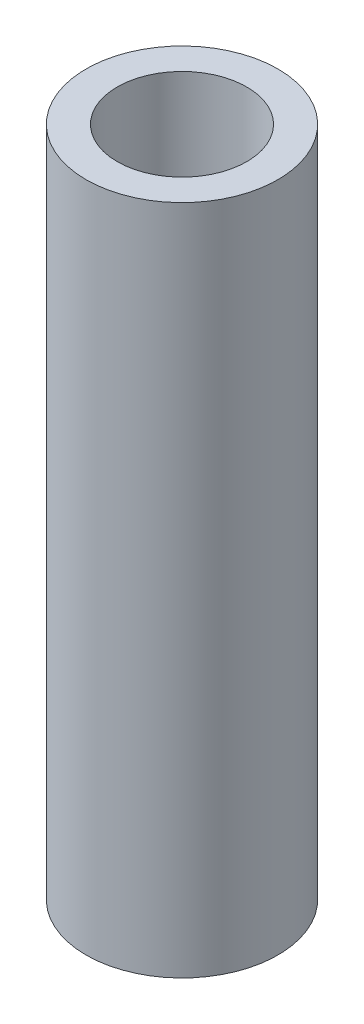
ISO-10303-21;
HEADER;
FILE_DESCRIPTION(('STEP AP214'),'2;1');
FILE_NAME('part.step','',(''),(''),'','','');
FILE_SCHEMA(('AUTOMOTIVE_DESIGN { 1 0 10303 214 1 1 1 1 }'));
ENDSEC;
DATA;
#1=APPLICATION_CONTEXT('core data for automotive mechanical design processes');
#2=APPLICATION_PROTOCOL_DEFINITION('international standard','automotive_design',2000,#1);
#3=PRODUCT_CONTEXT('',#1,'mechanical');
#4=PRODUCT('Part','Part','',(#3));
#5=PRODUCT_RELATED_PRODUCT_CATEGORY('part','',(#4));
#6=PRODUCT_DEFINITION_FORMATION('','',#4);
#7=PRODUCT_DEFINITION_CONTEXT('part definition',#1,'design');
#8=PRODUCT_DEFINITION('design','',#6,#7);
#9=PRODUCT_DEFINITION_SHAPE('','',#8);
#10=(LENGTH_UNIT() NAMED_UNIT(*) SI_UNIT(.MILLI.,.METRE.));
#11=(NAMED_UNIT(*) PLANE_ANGLE_UNIT() SI_UNIT($,.RADIAN.));
#12=(NAMED_UNIT(*) SI_UNIT($,.STERADIAN.) SOLID_ANGLE_UNIT());
#13=UNCERTAINTY_MEASURE_WITH_UNIT(LENGTH_MEASURE(1.E-05),#10,'distance_accuracy_value','');
#14=(GEOMETRIC_REPRESENTATION_CONTEXT(3) GLOBAL_UNCERTAINTY_ASSIGNED_CONTEXT((#13)) GLOBAL_UNIT_ASSIGNED_CONTEXT((#10,
#11,#12)) REPRESENTATION_CONTEXT('',''));
#15=CARTESIAN_POINT('',(0.,0.,0.));
#16=DIRECTION('',(0.,0.,1.));
#17=DIRECTION('',(1.,0.,0.));
#18=AXIS2_PLACEMENT_3D('',#15,#16,#17);
#19=CARTESIAN_POINT('',(0.,17.78,0.));
#20=DIRECTION('',(0.,1.,0.));
#21=DIRECTION('',(0.,0.,1.));
#22=AXIS2_PLACEMENT_3D('',#19,#20,#21);
#23=PLANE('',#22);
#24=CARTESIAN_POINT('',(0.,17.78,0.));
#25=DIRECTION('',(0.,1.,0.));
#26=DIRECTION('',(0.,0.,1.));
#27=AXIS2_PLACEMENT_3D('',#24,#25,#26);
#28=CIRCLE('',#27,2.54);
#29=CARTESIAN_POINT('',(0.,17.78,2.54));
#30=VERTEX_POINT('',#29);
#31=EDGE_CURVE('E10',#30,#30,#28,.T.);
#32=ORIENTED_EDGE('',*,*,#31,.T.);
#33=EDGE_LOOP('',(#32));
#34=FACE_BOUND('',#33,.T.);
#35=CARTESIAN_POINT('',(0.,17.78,0.));
#36=DIRECTION('',(0.,1.,0.));
#37=DIRECTION('',(0.,0.,1.));
#38=AXIS2_PLACEMENT_3D('',#35,#36,#37);
#39=CIRCLE('',#38,1.7145);
#40=CARTESIAN_POINT('',(0.,17.78,1.7145));
#41=VERTEX_POINT('',#40);
#42=EDGE_CURVE('E41',#41,#41,#39,.T.);
#43=ORIENTED_EDGE('',*,*,#42,.F.);
#44=EDGE_LOOP('',(#43));
#45=FACE_BOUND('',#44,.T.);
#46=ADVANCED_FACE('F30',(#34,#45),#23,.T.);
#47=CARTESIAN_POINT('',(0.,0.,0.));
#48=DIRECTION('',(0.,1.,0.));
#49=DIRECTION('',(0.,0.,1.));
#50=AXIS2_PLACEMENT_3D('',#47,#48,#49);
#51=PLANE('',#50);
#52=CARTESIAN_POINT('',(0.,0.,0.));
#53=DIRECTION('',(0.,1.,0.));
#54=DIRECTION('',(0.,0.,1.));
#55=AXIS2_PLACEMENT_3D('',#52,#53,#54);
#56=CIRCLE('',#55,2.54);
#57=CARTESIAN_POINT('',(0.,0.,2.54));
#58=VERTEX_POINT('',#57);
#59=EDGE_CURVE('E34',#58,#58,#56,.T.);
#60=ORIENTED_EDGE('',*,*,#59,.F.);
#61=EDGE_LOOP('',(#60));
#62=FACE_BOUND('',#61,.T.);
#63=CARTESIAN_POINT('',(0.,0.,0.));
#64=DIRECTION('',(0.,1.,0.));
#65=DIRECTION('',(0.,0.,1.));
#66=AXIS2_PLACEMENT_3D('',#63,#64,#65);
#67=CIRCLE('',#66,1.7145);
#68=CARTESIAN_POINT('',(0.,0.,1.7145));
#69=VERTEX_POINT('',#68);
#70=EDGE_CURVE('E43',#69,#69,#67,.T.);
#71=ORIENTED_EDGE('',*,*,#70,.T.);
#72=EDGE_LOOP('',(#71));
#73=FACE_BOUND('',#72,.T.);
#74=ADVANCED_FACE('F53',(#62,#73),#51,.F.);
#75=CARTESIAN_POINT('',(0.,17.78,0.));
#76=DIRECTION('',(0.,-1.,0.));
#77=DIRECTION('',(0.,0.,-1.));
#78=AXIS2_PLACEMENT_3D('',#75,#76,#77);
#79=CYLINDRICAL_SURFACE('',#78,2.54);
#80=ORIENTED_EDGE('',*,*,#31,.F.);
#81=EDGE_LOOP('',(#80));
#82=FACE_BOUND('',#81,.T.);
#83=ORIENTED_EDGE('',*,*,#59,.T.);
#84=EDGE_LOOP('',(#83));
#85=FACE_BOUND('',#84,.T.);
#86=ADVANCED_FACE('F32',(#82,#85),#79,.T.);
#87=CARTESIAN_POINT('',(0.,17.78,0.));
#88=DIRECTION('',(0.,-1.,0.));
#89=DIRECTION('',(0.,0.,-1.));
#90=AXIS2_PLACEMENT_3D('',#87,#88,#89);
#91=CYLINDRICAL_SURFACE('',#90,1.7145);
#92=ORIENTED_EDGE('',*,*,#42,.T.);
#93=EDGE_LOOP('',(#92));
#94=FACE_BOUND('',#93,.T.);
#95=ORIENTED_EDGE('',*,*,#70,.F.);
#96=EDGE_LOOP('',(#95));
#97=FACE_BOUND('',#96,.T.);
#98=ADVANCED_FACE('F49',(#94,#97),#91,.F.);
#99=CLOSED_SHELL('',(#46,#74,#86,#98));
#100=MANIFOLD_SOLID_BREP('B2',#99);
#101=ADVANCED_BREP_SHAPE_REPRESENTATION('',(#18,#100),#14);
#102=SHAPE_DEFINITION_REPRESENTATION(#9,#101);
ENDSEC;
END-ISO-10303-21;
